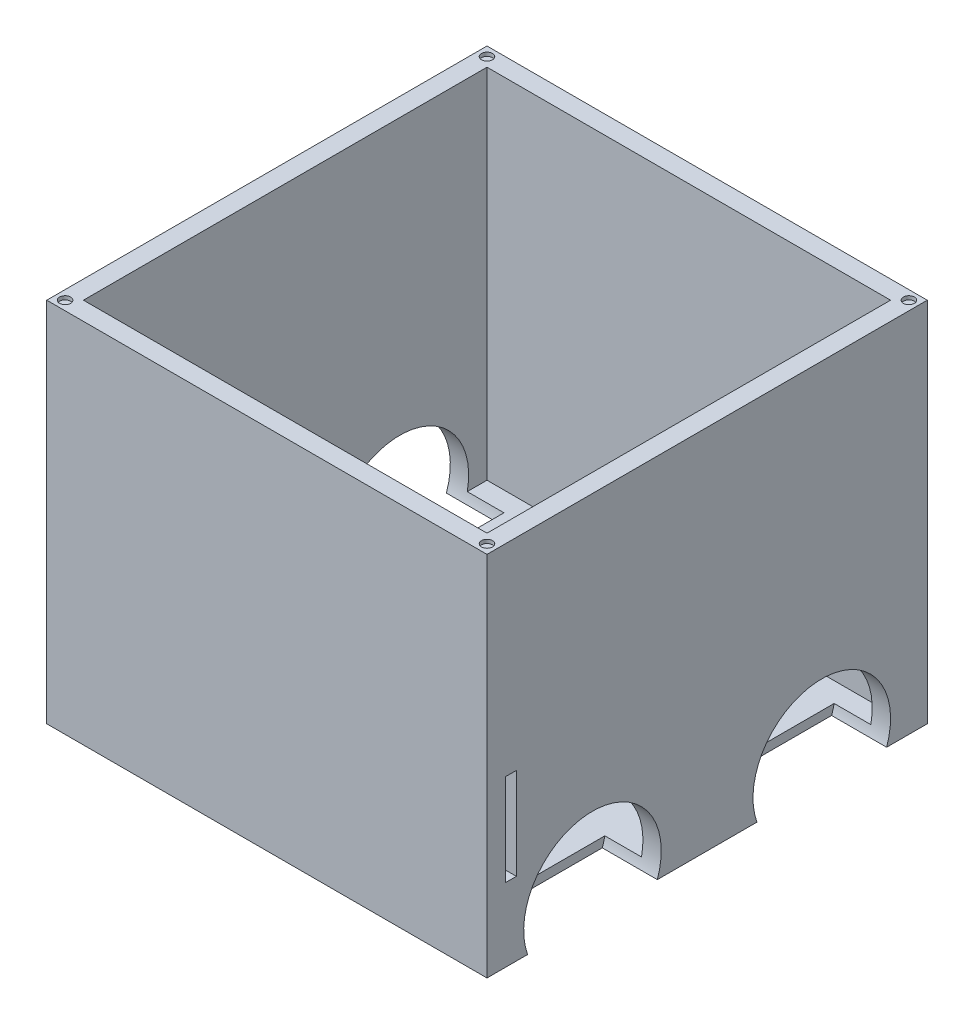
ISO-10303-21;
HEADER;
FILE_DESCRIPTION(('STEP AP214'),'2;1');
FILE_NAME('part.step','',(''),(''),'','','');
FILE_SCHEMA(('AUTOMOTIVE_DESIGN { 1 0 10303 214 1 1 1 1 }'));
ENDSEC;
DATA;
#1=APPLICATION_CONTEXT('core data for automotive mechanical design processes');
#2=APPLICATION_PROTOCOL_DEFINITION('international standard','automotive_design',2000,#1);
#3=PRODUCT_CONTEXT('',#1,'mechanical');
#4=PRODUCT('Part','Part','',(#3));
#5=PRODUCT_RELATED_PRODUCT_CATEGORY('part','',(#4));
#6=PRODUCT_DEFINITION_FORMATION('','',#4);
#7=PRODUCT_DEFINITION_CONTEXT('part definition',#1,'design');
#8=PRODUCT_DEFINITION('design','',#6,#7);
#9=PRODUCT_DEFINITION_SHAPE('','',#8);
#10=(LENGTH_UNIT() NAMED_UNIT(*) SI_UNIT(.MILLI.,.METRE.));
#11=(NAMED_UNIT(*) PLANE_ANGLE_UNIT() SI_UNIT($,.RADIAN.));
#12=(NAMED_UNIT(*) SI_UNIT($,.STERADIAN.) SOLID_ANGLE_UNIT());
#13=UNCERTAINTY_MEASURE_WITH_UNIT(LENGTH_MEASURE(1.E-05),#10,'distance_accuracy_value','');
#14=(GEOMETRIC_REPRESENTATION_CONTEXT(3) GLOBAL_UNCERTAINTY_ASSIGNED_CONTEXT((#13)) GLOBAL_UNIT_ASSIGNED_CONTEXT((#10,
#11,#12)) REPRESENTATION_CONTEXT('',''));
#15=CARTESIAN_POINT('',(0.,0.,0.));
#16=DIRECTION('',(0.,0.,1.));
#17=DIRECTION('',(1.,0.,0.));
#18=AXIS2_PLACEMENT_3D('',#15,#16,#17);
#19=CARTESIAN_POINT('',(120.,86.8979784031339,120.));
#20=DIRECTION('',(-1.,0.,0.));
#21=DIRECTION('',(0.,0.,1.));
#22=AXIS2_PLACEMENT_3D('',#19,#20,#21);
#23=PLANE('',#22);
#24=DIRECTION('',(0.,0.,-1.));
#25=VECTOR('',#24,1.);
#26=CARTESIAN_POINT('',(120.,-113.102021596866,120.));
#27=LINE('',#26,#25);
#28=CARTESIAN_POINT('',(120.,-113.102021596866,120.));
#29=VERTEX_POINT('',#28);
#30=CARTESIAN_POINT('',(120.,-113.102021596866,97.8553390593274));
#31=VERTEX_POINT('',#30);
#32=EDGE_CURVE('E432',#29,#31,#27,.T.);
#33=ORIENTED_EDGE('',*,*,#32,.T.);
#34=CARTESIAN_POINT('',(120.,-100.602021596866,62.5));
#35=DIRECTION('',(1.,0.,0.));
#36=DIRECTION('',(0.,0.,-1.));
#37=AXIS2_PLACEMENT_3D('',#34,#35,#36);
#38=CIRCLE('',#37,37.5);
#39=CARTESIAN_POINT('',(120.,-113.102021596866,27.1446609406726));
#40=VERTEX_POINT('',#39);
#41=EDGE_CURVE('E355',#40,#31,#38,.T.);
#42=ORIENTED_EDGE('',*,*,#41,.F.);
#43=CARTESIAN_POINT('',(120.,-113.102021596866,-27.1446609406726));
#44=VERTEX_POINT('',#43);
#45=EDGE_CURVE('E436',#40,#44,#27,.T.);
#46=ORIENTED_EDGE('',*,*,#45,.T.);
#47=CARTESIAN_POINT('',(120.,-100.602021596866,-62.5));
#48=DIRECTION('',(1.,0.,0.));
#49=DIRECTION('',(0.,0.,-1.));
#50=AXIS2_PLACEMENT_3D('',#47,#48,#49);
#51=CIRCLE('',#50,37.5);
#52=CARTESIAN_POINT('',(120.,-113.102021596866,-97.8553390593274));
#53=VERTEX_POINT('',#52);
#54=EDGE_CURVE('E357',#53,#44,#51,.T.);
#55=ORIENTED_EDGE('',*,*,#54,.F.);
#56=CARTESIAN_POINT('',(120.,-113.102021596866,-120.));
#57=VERTEX_POINT('',#56);
#58=EDGE_CURVE('E411',#53,#57,#27,.T.);
#59=ORIENTED_EDGE('',*,*,#58,.T.);
#60=DIRECTION('',(0.,-1.,0.));
#61=VECTOR('',#60,1.);
#62=CARTESIAN_POINT('',(120.,86.8979784031339,-120.));
#63=LINE('',#62,#61);
#64=CARTESIAN_POINT('',(120.,86.8979784031339,-120.));
#65=VERTEX_POINT('',#64);
#66=EDGE_CURVE('E452',#65,#57,#63,.T.);
#67=ORIENTED_EDGE('',*,*,#66,.F.);
#68=DIRECTION('',(0.,0.,-1.));
#69=VECTOR('',#68,1.);
#70=CARTESIAN_POINT('',(120.,86.8979784031339,120.));
#71=LINE('',#70,#69);
#72=CARTESIAN_POINT('',(120.,86.8979784031339,120.));
#73=VERTEX_POINT('',#72);
#74=EDGE_CURVE('E421',#73,#65,#71,.T.);
#75=ORIENTED_EDGE('',*,*,#74,.F.);
#76=DIRECTION('',(0.,-1.,0.));
#77=VECTOR('',#76,1.);
#78=CARTESIAN_POINT('',(120.,86.8979784031339,120.));
#79=LINE('',#78,#77);
#80=EDGE_CURVE('E431',#73,#29,#79,.T.);
#81=ORIENTED_EDGE('',*,*,#80,.T.);
#82=EDGE_LOOP('',(#33,#42,#46,#55,#59,#67,#75,#81));
#83=FACE_BOUND('',#82,.T.);
#84=DIRECTION('',(0.,0.,1.));
#85=VECTOR('',#84,1.);
#86=CARTESIAN_POINT('',(120.,-23.1020215968661,104.));
#87=LINE('',#86,#85);
#88=CARTESIAN_POINT('',(120.,-23.1020215968661,104.));
#89=VERTEX_POINT('',#88);
#90=CARTESIAN_POINT('',(120.,-23.1020215968661,110.));
#91=VERTEX_POINT('',#90);
#92=EDGE_CURVE('E246',#89,#91,#87,.T.);
#93=ORIENTED_EDGE('',*,*,#92,.F.);
#94=DIRECTION('',(0.,1.,0.));
#95=VECTOR('',#94,1.);
#96=CARTESIAN_POINT('',(120.,-73.1020215968661,104.));
#97=LINE('',#96,#95);
#98=CARTESIAN_POINT('',(120.,-73.1020215968661,104.));
#99=VERTEX_POINT('',#98);
#100=EDGE_CURVE('E271',#99,#89,#97,.T.);
#101=ORIENTED_EDGE('',*,*,#100,.F.);
#102=DIRECTION('',(0.,0.,-1.));
#103=VECTOR('',#102,1.);
#104=CARTESIAN_POINT('',(120.,-73.1020215968661,110.));
#105=LINE('',#104,#103);
#106=CARTESIAN_POINT('',(120.,-73.1020215968661,110.));
#107=VERTEX_POINT('',#106);
#108=EDGE_CURVE('E269',#107,#99,#105,.T.);
#109=ORIENTED_EDGE('',*,*,#108,.F.);
#110=DIRECTION('',(0.,-1.,0.));
#111=VECTOR('',#110,1.);
#112=CARTESIAN_POINT('',(120.,-23.1020215968661,110.));
#113=LINE('',#112,#111);
#114=EDGE_CURVE('E256',#91,#107,#113,.T.);
#115=ORIENTED_EDGE('',*,*,#114,.F.);
#116=EDGE_LOOP('',(#93,#101,#109,#115));
#117=FACE_BOUND('',#116,.T.);
#118=ADVANCED_FACE('F39',(#83,#117),#23,.F.);
#119=CARTESIAN_POINT('',(-120.,86.8979784031339,120.));
#120=DIRECTION('',(1.,0.,0.));
#121=DIRECTION('',(0.,0.,-1.));
#122=AXIS2_PLACEMENT_3D('',#119,#120,#121);
#123=PLANE('',#122);
#124=DIRECTION('',(0.,0.,1.));
#125=VECTOR('',#124,1.);
#126=CARTESIAN_POINT('',(-120.,-113.102021596866,120.));
#127=LINE('',#126,#125);
#128=CARTESIAN_POINT('',(-120.,-113.102021596866,-27.1446609406726));
#129=VERTEX_POINT('',#128);
#130=CARTESIAN_POINT('',(-120.,-113.102021596866,27.1446609406726));
#131=VERTEX_POINT('',#130);
#132=EDGE_CURVE('E442',#129,#131,#127,.T.);
#133=ORIENTED_EDGE('',*,*,#132,.T.);
#134=CARTESIAN_POINT('',(-120.,-100.602021596866,62.5));
#135=DIRECTION('',(-1.,0.,0.));
#136=DIRECTION('',(0.,0.,1.));
#137=AXIS2_PLACEMENT_3D('',#134,#135,#136);
#138=CIRCLE('',#137,37.5);
#139=CARTESIAN_POINT('',(-120.,-113.102021596866,97.8553390593274));
#140=VERTEX_POINT('',#139);
#141=EDGE_CURVE('E323',#140,#131,#138,.T.);
#142=ORIENTED_EDGE('',*,*,#141,.F.);
#143=CARTESIAN_POINT('',(-120.,-113.102021596866,120.));
#144=VERTEX_POINT('',#143);
#145=EDGE_CURVE('E438',#140,#144,#127,.T.);
#146=ORIENTED_EDGE('',*,*,#145,.T.);
#147=DIRECTION('',(0.,-1.,0.));
#148=VECTOR('',#147,1.);
#149=CARTESIAN_POINT('',(-120.,86.8979784031339,120.));
#150=LINE('',#149,#148);
#151=CARTESIAN_POINT('',(-120.,86.8979784031339,120.));
#152=VERTEX_POINT('',#151);
#153=EDGE_CURVE('E446',#152,#144,#150,.T.);
#154=ORIENTED_EDGE('',*,*,#153,.F.);
#155=DIRECTION('',(0.,0.,1.));
#156=VECTOR('',#155,1.);
#157=CARTESIAN_POINT('',(-120.,86.8979784031339,120.));
#158=LINE('',#157,#156);
#159=CARTESIAN_POINT('',(-120.,86.8979784031339,-120.));
#160=VERTEX_POINT('',#159);
#161=EDGE_CURVE('E427',#160,#152,#158,.T.);
#162=ORIENTED_EDGE('',*,*,#161,.F.);
#163=DIRECTION('',(0.,-1.,0.));
#164=VECTOR('',#163,1.);
#165=CARTESIAN_POINT('',(-120.,86.8979784031339,-120.));
#166=LINE('',#165,#164);
#167=CARTESIAN_POINT('',(-120.,-113.102021596866,-120.));
#168=VERTEX_POINT('',#167);
#169=EDGE_CURVE('E449',#160,#168,#166,.T.);
#170=ORIENTED_EDGE('',*,*,#169,.T.);
#171=CARTESIAN_POINT('',(-120.,-113.102021596866,-97.8553390593274));
#172=VERTEX_POINT('',#171);
#173=EDGE_CURVE('E439',#168,#172,#127,.T.);
#174=ORIENTED_EDGE('',*,*,#173,.T.);
#175=CARTESIAN_POINT('',(-120.,-100.602021596866,-62.5));
#176=DIRECTION('',(-1.,0.,0.));
#177=DIRECTION('',(0.,0.,1.));
#178=AXIS2_PLACEMENT_3D('',#175,#176,#177);
#179=CIRCLE('',#178,37.5);
#180=EDGE_CURVE('E325',#129,#172,#179,.T.);
#181=ORIENTED_EDGE('',*,*,#180,.F.);
#182=EDGE_LOOP('',(#133,#142,#146,#154,#162,#170,#174,#181));
#183=FACE_BOUND('',#182,.T.);
#184=DIRECTION('',(0.,0.,-1.));
#185=VECTOR('',#184,1.);
#186=CARTESIAN_POINT('',(-120.,-23.1020215968661,120.));
#187=LINE('',#186,#185);
#188=CARTESIAN_POINT('',(-120.,-23.1020215968661,110.));
#189=VERTEX_POINT('',#188);
#190=CARTESIAN_POINT('',(-120.,-23.1020215968661,104.));
#191=VERTEX_POINT('',#190);
#192=EDGE_CURVE('E292',#189,#191,#187,.T.);
#193=ORIENTED_EDGE('',*,*,#192,.F.);
#194=DIRECTION('',(0.,1.,0.));
#195=VECTOR('',#194,1.);
#196=CARTESIAN_POINT('',(-120.,86.8979784031339,110.));
#197=LINE('',#196,#195);
#198=CARTESIAN_POINT('',(-120.,-73.1020215968661,110.));
#199=VERTEX_POINT('',#198);
#200=EDGE_CURVE('E288',#199,#189,#197,.T.);
#201=ORIENTED_EDGE('',*,*,#200,.F.);
#202=DIRECTION('',(0.,0.,1.));
#203=VECTOR('',#202,1.);
#204=CARTESIAN_POINT('',(-120.,-73.1020215968661,120.));
#205=LINE('',#204,#203);
#206=CARTESIAN_POINT('',(-120.,-73.1020215968661,104.));
#207=VERTEX_POINT('',#206);
#208=EDGE_CURVE('E286',#207,#199,#205,.T.);
#209=ORIENTED_EDGE('',*,*,#208,.F.);
#210=DIRECTION('',(0.,-1.,0.));
#211=VECTOR('',#210,1.);
#212=CARTESIAN_POINT('',(-120.,86.8979784031339,104.));
#213=LINE('',#212,#211);
#214=EDGE_CURVE('E282',#191,#207,#213,.T.);
#215=ORIENTED_EDGE('',*,*,#214,.F.);
#216=EDGE_LOOP('',(#193,#201,#209,#215));
#217=FACE_BOUND('',#216,.T.);
#218=ADVANCED_FACE('F510',(#183,#217),#123,.F.);
#219=CARTESIAN_POINT('',(110.,-108.102021596866,-110.));
#220=DIRECTION('',(1.,0.,0.));
#221=DIRECTION('',(0.,0.,-1.));
#222=AXIS2_PLACEMENT_3D('',#219,#220,#221);
#223=PLANE('',#222);
#224=DIRECTION('',(0.,0.,-1.));
#225=VECTOR('',#224,1.);
#226=CARTESIAN_POINT('',(110.,-23.1020215968661,-110.));
#227=LINE('',#226,#225);
#228=CARTESIAN_POINT('',(110.,-23.1020215968661,110.));
#229=VERTEX_POINT('',#228);
#230=CARTESIAN_POINT('',(110.,-23.1020215968661,104.));
#231=VERTEX_POINT('',#230);
#232=EDGE_CURVE('E290',#229,#231,#227,.T.);
#233=ORIENTED_EDGE('',*,*,#232,.F.);
#234=DIRECTION('',(0.,1.,0.));
#235=VECTOR('',#234,1.);
#236=CARTESIAN_POINT('',(110.,-108.102021596866,110.));
#237=LINE('',#236,#235);
#238=CARTESIAN_POINT('',(110.,86.8979784031339,110.));
#239=VERTEX_POINT('',#238);
#240=EDGE_CURVE('E264',#229,#239,#237,.T.);
#241=ORIENTED_EDGE('',*,*,#240,.T.);
#242=DIRECTION('',(0.,0.,-1.));
#243=VECTOR('',#242,1.);
#244=CARTESIAN_POINT('',(110.,86.8979784031339,-110.));
#245=LINE('',#244,#243);
#246=CARTESIAN_POINT('',(110.,86.8979784031339,-110.));
#247=VERTEX_POINT('',#246);
#248=EDGE_CURVE('E387',#239,#247,#245,.T.);
#249=ORIENTED_EDGE('',*,*,#248,.T.);
#250=DIRECTION('',(0.,1.,0.));
#251=VECTOR('',#250,1.);
#252=CARTESIAN_POINT('',(110.,-108.102021596866,-110.));
#253=LINE('',#252,#251);
#254=CARTESIAN_POINT('',(110.,-108.102021596866,-110.));
#255=VERTEX_POINT('',#254);
#256=EDGE_CURVE('E409',#255,#247,#253,.T.);
#257=ORIENTED_EDGE('',*,*,#256,.F.);
#258=DIRECTION('',(0.,0.,-1.));
#259=VECTOR('',#258,1.);
#260=CARTESIAN_POINT('',(110.,-108.102021596866,-110.));
#261=LINE('',#260,#259);
#262=CARTESIAN_POINT('',(110.,-108.102021596866,-99.2423461417477));
#263=VERTEX_POINT('',#262);
#264=EDGE_CURVE('E395',#263,#255,#261,.T.);
#265=ORIENTED_EDGE('',*,*,#264,.F.);
#266=CARTESIAN_POINT('',(110.,-100.602021596866,-62.5));
#267=DIRECTION('',(1.,0.,0.));
#268=DIRECTION('',(0.,0.,-1.));
#269=AXIS2_PLACEMENT_3D('',#266,#267,#268);
#270=CIRCLE('',#269,37.5);
#271=CARTESIAN_POINT('',(110.,-108.102021596866,-25.7576538582523));
#272=VERTEX_POINT('',#271);
#273=EDGE_CURVE('E363',#263,#272,#270,.T.);
#274=ORIENTED_EDGE('',*,*,#273,.T.);
#275=CARTESIAN_POINT('',(110.,-108.102021596866,25.7576538582523));
#276=VERTEX_POINT('',#275);
#277=EDGE_CURVE('E400',#276,#272,#261,.T.);
#278=ORIENTED_EDGE('',*,*,#277,.F.);
#279=CARTESIAN_POINT('',(110.,-100.602021596866,62.5));
#280=DIRECTION('',(1.,0.,0.));
#281=DIRECTION('',(0.,0.,-1.));
#282=AXIS2_PLACEMENT_3D('',#279,#280,#281);
#283=CIRCLE('',#282,37.5);
#284=CARTESIAN_POINT('',(110.,-108.102021596866,99.2423461417477));
#285=VERTEX_POINT('',#284);
#286=EDGE_CURVE('E374',#276,#285,#283,.T.);
#287=ORIENTED_EDGE('',*,*,#286,.T.);
#288=CARTESIAN_POINT('',(110.,-108.102021596866,110.));
#289=VERTEX_POINT('',#288);
#290=EDGE_CURVE('E396',#289,#285,#261,.T.);
#291=ORIENTED_EDGE('',*,*,#290,.F.);
#292=CARTESIAN_POINT('',(110.,-73.1020215968661,110.));
#293=VERTEX_POINT('',#292);
#294=EDGE_CURVE('E412',#289,#293,#237,.T.);
#295=ORIENTED_EDGE('',*,*,#294,.T.);
#296=DIRECTION('',(0.,0.,1.));
#297=VECTOR('',#296,1.);
#298=CARTESIAN_POINT('',(110.,-73.1020215968661,-110.));
#299=LINE('',#298,#297);
#300=CARTESIAN_POINT('',(110.,-73.1020215968661,104.));
#301=VERTEX_POINT('',#300);
#302=EDGE_CURVE('E284',#301,#293,#299,.T.);
#303=ORIENTED_EDGE('',*,*,#302,.F.);
#304=DIRECTION('',(0.,-1.,0.));
#305=VECTOR('',#304,1.);
#306=CARTESIAN_POINT('',(110.,-108.102021596866,104.));
#307=LINE('',#306,#305);
#308=EDGE_CURVE('E265',#231,#301,#307,.T.);
#309=ORIENTED_EDGE('',*,*,#308,.F.);
#310=EDGE_LOOP('',(#233,#241,#249,#257,#265,#274,#278,#287,#291,#295,#303,#309));
#311=FACE_BOUND('',#310,.T.);
#312=ADVANCED_FACE('F535',(#311),#223,.F.);
#313=CARTESIAN_POINT('',(-110.,-108.102021596866,110.));
#314=DIRECTION('',(-1.,0.,0.));
#315=DIRECTION('',(0.,0.,1.));
#316=AXIS2_PLACEMENT_3D('',#313,#314,#315);
#317=PLANE('',#316);
#318=DIRECTION('',(0.,0.,1.));
#319=VECTOR('',#318,1.);
#320=CARTESIAN_POINT('',(-110.,-23.1020215968661,110.));
#321=LINE('',#320,#319);
#322=CARTESIAN_POINT('',(-110.,-23.1020215968661,104.));
#323=VERTEX_POINT('',#322);
#324=CARTESIAN_POINT('',(-110.,-23.1020215968661,110.));
#325=VERTEX_POINT('',#324);
#326=EDGE_CURVE('E11',#323,#325,#321,.T.);
#327=ORIENTED_EDGE('',*,*,#326,.F.);
#328=DIRECTION('',(0.,1.,0.));
#329=VECTOR('',#328,1.);
#330=CARTESIAN_POINT('',(-110.,-108.102021596866,104.));
#331=LINE('',#330,#329);
#332=CARTESIAN_POINT('',(-110.,-73.1020215968661,104.));
#333=VERTEX_POINT('',#332);
#334=EDGE_CURVE('E487',#333,#323,#331,.T.);
#335=ORIENTED_EDGE('',*,*,#334,.F.);
#336=DIRECTION('',(0.,0.,-1.));
#337=VECTOR('',#336,1.);
#338=CARTESIAN_POINT('',(-110.,-73.1020215968661,110.));
#339=LINE('',#338,#337);
#340=CARTESIAN_POINT('',(-110.,-73.1020215968661,110.));
#341=VERTEX_POINT('',#340);
#342=EDGE_CURVE('E46',#341,#333,#339,.T.);
#343=ORIENTED_EDGE('',*,*,#342,.F.);
#344=DIRECTION('',(0.,1.,0.));
#345=VECTOR('',#344,1.);
#346=CARTESIAN_POINT('',(-110.,-108.102021596866,110.));
#347=LINE('',#346,#345);
#348=CARTESIAN_POINT('',(-110.,-108.102021596866,110.));
#349=VERTEX_POINT('',#348);
#350=EDGE_CURVE('E415',#349,#341,#347,.T.);
#351=ORIENTED_EDGE('',*,*,#350,.F.);
#352=DIRECTION('',(0.,0.,1.));
#353=VECTOR('',#352,1.);
#354=CARTESIAN_POINT('',(-110.,-108.102021596866,110.));
#355=LINE('',#354,#353);
#356=CARTESIAN_POINT('',(-110.,-108.102021596866,99.2423461417477));
#357=VERTEX_POINT('',#356);
#358=EDGE_CURVE('E386',#357,#349,#355,.T.);
#359=ORIENTED_EDGE('',*,*,#358,.F.);
#360=CARTESIAN_POINT('',(-110.,-100.602021596866,62.5));
#361=DIRECTION('',(-1.,0.,0.));
#362=DIRECTION('',(0.,0.,1.));
#363=AXIS2_PLACEMENT_3D('',#360,#361,#362);
#364=CIRCLE('',#363,37.5);
#365=CARTESIAN_POINT('',(-110.,-108.102021596866,25.7576538582523));
#366=VERTEX_POINT('',#365);
#367=EDGE_CURVE('E342',#357,#366,#364,.T.);
#368=ORIENTED_EDGE('',*,*,#367,.T.);
#369=CARTESIAN_POINT('',(-110.,-108.102021596866,-25.7576538582523));
#370=VERTEX_POINT('',#369);
#371=EDGE_CURVE('E392',#370,#366,#355,.T.);
#372=ORIENTED_EDGE('',*,*,#371,.F.);
#373=CARTESIAN_POINT('',(-110.,-100.602021596866,-62.5));
#374=DIRECTION('',(-1.,0.,0.));
#375=DIRECTION('',(0.,0.,1.));
#376=AXIS2_PLACEMENT_3D('',#373,#374,#375);
#377=CIRCLE('',#376,37.5);
#378=CARTESIAN_POINT('',(-110.,-108.102021596866,-99.2423461417477));
#379=VERTEX_POINT('',#378);
#380=EDGE_CURVE('E331',#370,#379,#377,.T.);
#381=ORIENTED_EDGE('',*,*,#380,.T.);
#382=CARTESIAN_POINT('',(-110.,-108.102021596866,-110.));
#383=VERTEX_POINT('',#382);
#384=EDGE_CURVE('E388',#383,#379,#355,.T.);
#385=ORIENTED_EDGE('',*,*,#384,.F.);
#386=DIRECTION('',(0.,1.,0.));
#387=VECTOR('',#386,1.);
#388=CARTESIAN_POINT('',(-110.,-108.102021596866,-110.));
#389=LINE('',#388,#387);
#390=CARTESIAN_POINT('',(-110.,86.8979784031339,-110.));
#391=VERTEX_POINT('',#390);
#392=EDGE_CURVE('E399',#383,#391,#389,.T.);
#393=ORIENTED_EDGE('',*,*,#392,.T.);
#394=DIRECTION('',(0.,0.,1.));
#395=VECTOR('',#394,1.);
#396=CARTESIAN_POINT('',(-110.,86.8979784031339,110.));
#397=LINE('',#396,#395);
#398=CARTESIAN_POINT('',(-110.,86.8979784031339,110.));
#399=VERTEX_POINT('',#398);
#400=EDGE_CURVE('E402',#391,#399,#397,.T.);
#401=ORIENTED_EDGE('',*,*,#400,.T.);
#402=EDGE_CURVE('E418',#325,#399,#347,.T.);
#403=ORIENTED_EDGE('',*,*,#402,.F.);
#404=EDGE_LOOP('',(#327,#335,#343,#351,#359,#368,#372,#381,#385,#393,#401,#403));
#405=FACE_BOUND('',#404,.T.);
#406=ADVANCED_FACE('F499',(#405),#317,.F.);
#407=CARTESIAN_POINT('',(-120.,86.8979784031339,-120.));
#408=DIRECTION('',(0.,0.,1.));
#409=DIRECTION('',(1.,0.,0.));
#410=AXIS2_PLACEMENT_3D('',#407,#408,#409);
#411=PLANE('',#410);
#412=DIRECTION('',(-1.,0.,0.));
#413=VECTOR('',#412,1.);
#414=CARTESIAN_POINT('',(-120.,-113.102021596866,-120.));
#415=LINE('',#414,#413);
#416=EDGE_CURVE('E435',#57,#168,#415,.T.);
#417=ORIENTED_EDGE('',*,*,#416,.T.);
#418=ORIENTED_EDGE('',*,*,#169,.F.);
#419=DIRECTION('',(-1.,0.,0.));
#420=VECTOR('',#419,1.);
#421=CARTESIAN_POINT('',(-120.,86.8979784031339,-120.));
#422=LINE('',#421,#420);
#423=EDGE_CURVE('E424',#65,#160,#422,.T.);
#424=ORIENTED_EDGE('',*,*,#423,.F.);
#425=ORIENTED_EDGE('',*,*,#66,.T.);
#426=EDGE_LOOP('',(#417,#418,#424,#425));
#427=FACE_BOUND('',#426,.T.);
#428=ADVANCED_FACE('F579',(#427),#411,.F.);
#429=CARTESIAN_POINT('',(-120.,86.8979784031339,120.));
#430=DIRECTION('',(0.,0.,-1.));
#431=DIRECTION('',(-1.,0.,0.));
#432=AXIS2_PLACEMENT_3D('',#429,#430,#431);
#433=PLANE('',#432);
#434=DIRECTION('',(1.,0.,0.));
#435=VECTOR('',#434,1.);
#436=CARTESIAN_POINT('',(-120.,-113.102021596866,120.));
#437=LINE('',#436,#435);
#438=EDGE_CURVE('E425',#144,#29,#437,.T.);
#439=ORIENTED_EDGE('',*,*,#438,.T.);
#440=ORIENTED_EDGE('',*,*,#80,.F.);
#441=DIRECTION('',(1.,0.,0.));
#442=VECTOR('',#441,1.);
#443=CARTESIAN_POINT('',(-120.,86.8979784031339,120.));
#444=LINE('',#443,#442);
#445=EDGE_CURVE('E429',#152,#73,#444,.T.);
#446=ORIENTED_EDGE('',*,*,#445,.F.);
#447=ORIENTED_EDGE('',*,*,#153,.T.);
#448=EDGE_LOOP('',(#439,#440,#446,#447));
#449=FACE_BOUND('',#448,.T.);
#450=ADVANCED_FACE('F587',(#449),#433,.F.);
#451=CARTESIAN_POINT('',(0.,86.8979784031339,0.));
#452=DIRECTION('',(0.,-1.,0.));
#453=DIRECTION('',(0.,0.,-1.));
#454=AXIS2_PLACEMENT_3D('',#451,#452,#453);
#455=PLANE('',#454);
#456=CARTESIAN_POINT('',(115.,86.8979784031339,-115.));
#457=DIRECTION('',(0.,1.,0.));
#458=DIRECTION('',(0.,0.,-1.));
#459=AXIS2_PLACEMENT_3D('',#456,#457,#458);
#460=CIRCLE('',#459,3.00000000000001);
#461=CARTESIAN_POINT('',(115.,86.8979784031339,-118.));
#462=VERTEX_POINT('',#461);
#463=EDGE_CURVE('E308',#462,#462,#460,.T.);
#464=ORIENTED_EDGE('',*,*,#463,.F.);
#465=EDGE_LOOP('',(#464));
#466=FACE_BOUND('',#465,.T.);
#467=CARTESIAN_POINT('',(115.,86.8979784031339,115.));
#468=DIRECTION('',(0.,1.,0.));
#469=DIRECTION('',(0.,0.,1.));
#470=AXIS2_PLACEMENT_3D('',#467,#468,#469);
#471=CIRCLE('',#470,3.00000000000001);
#472=CARTESIAN_POINT('',(115.,86.8979784031339,118.));
#473=VERTEX_POINT('',#472);
#474=EDGE_CURVE('E302',#473,#473,#471,.T.);
#475=ORIENTED_EDGE('',*,*,#474,.F.);
#476=EDGE_LOOP('',(#475));
#477=FACE_BOUND('',#476,.T.);
#478=CARTESIAN_POINT('',(-115.,86.8979784031339,115.));
#479=DIRECTION('',(0.,1.,0.));
#480=DIRECTION('',(0.,0.,-1.));
#481=AXIS2_PLACEMENT_3D('',#478,#479,#480);
#482=CIRCLE('',#481,3.00000000000001);
#483=CARTESIAN_POINT('',(-115.,86.8979784031339,112.));
#484=VERTEX_POINT('',#483);
#485=EDGE_CURVE('E295',#484,#484,#482,.T.);
#486=ORIENTED_EDGE('',*,*,#485,.F.);
#487=EDGE_LOOP('',(#486));
#488=FACE_BOUND('',#487,.T.);
#489=CARTESIAN_POINT('',(-115.,86.8979784031339,-115.));
#490=DIRECTION('',(0.,1.,0.));
#491=DIRECTION('',(0.,0.,1.));
#492=AXIS2_PLACEMENT_3D('',#489,#490,#491);
#493=CIRCLE('',#492,3.00000000000001);
#494=CARTESIAN_POINT('',(-115.,86.8979784031339,-112.));
#495=VERTEX_POINT('',#494);
#496=EDGE_CURVE('E298',#495,#495,#493,.T.);
#497=ORIENTED_EDGE('',*,*,#496,.F.);
#498=EDGE_LOOP('',(#497));
#499=FACE_BOUND('',#498,.T.);
#500=ORIENTED_EDGE('',*,*,#400,.F.);
#501=DIRECTION('',(-1.,0.,0.));
#502=VECTOR('',#501,1.);
#503=CARTESIAN_POINT('',(-110.,86.8979784031339,-110.));
#504=LINE('',#503,#502);
#505=EDGE_CURVE('E382',#247,#391,#504,.T.);
#506=ORIENTED_EDGE('',*,*,#505,.F.);
#507=ORIENTED_EDGE('',*,*,#248,.F.);
#508=DIRECTION('',(1.,0.,0.));
#509=VECTOR('',#508,1.);
#510=CARTESIAN_POINT('',(110.,86.8979784031339,110.));
#511=LINE('',#510,#509);
#512=EDGE_CURVE('E405',#399,#239,#511,.T.);
#513=ORIENTED_EDGE('',*,*,#512,.F.);
#514=EDGE_LOOP('',(#500,#506,#507,#513));
#515=FACE_BOUND('',#514,.T.);
#516=ORIENTED_EDGE('',*,*,#74,.T.);
#517=ORIENTED_EDGE('',*,*,#423,.T.);
#518=ORIENTED_EDGE('',*,*,#161,.T.);
#519=ORIENTED_EDGE('',*,*,#445,.T.);
#520=EDGE_LOOP('',(#516,#517,#518,#519));
#521=FACE_BOUND('',#520,.T.);
#522=ADVANCED_FACE('F531',(#466,#477,#488,#499,#515,#521),#455,.F.);
#523=CARTESIAN_POINT('',(0.,-113.102021596866,0.));
#524=DIRECTION('',(0.,-1.,0.));
#525=DIRECTION('',(0.,0.,-1.));
#526=AXIS2_PLACEMENT_3D('',#523,#524,#525);
#527=PLANE('',#526);
#528=DIRECTION('',(-1.,0.,0.));
#529=VECTOR('',#528,1.);
#530=CARTESIAN_POINT('',(-90.,-113.102021596866,97.8553390593274));
#531=LINE('',#530,#529);
#532=CARTESIAN_POINT('',(-90.,-113.102021596866,97.8553390593274));
#533=VERTEX_POINT('',#532);
#534=EDGE_CURVE('E348',#533,#140,#531,.T.);
#535=ORIENTED_EDGE('',*,*,#534,.F.);
#536=DIRECTION('',(0.,0.,-1.));
#537=VECTOR('',#536,1.);
#538=CARTESIAN_POINT('',(-90.,-113.102021596866,0.));
#539=LINE('',#538,#537);
#540=CARTESIAN_POINT('',(-90.,-113.102021596866,27.1446609406726));
#541=VERTEX_POINT('',#540);
#542=EDGE_CURVE('E339',#533,#541,#539,.T.);
#543=ORIENTED_EDGE('',*,*,#542,.T.);
#544=DIRECTION('',(-1.,0.,0.));
#545=VECTOR('',#544,1.);
#546=CARTESIAN_POINT('',(-90.,-113.102021596866,27.1446609406726));
#547=LINE('',#546,#545);
#548=EDGE_CURVE('E345',#131,#541,#547,.F.);
#549=ORIENTED_EDGE('',*,*,#548,.F.);
#550=ORIENTED_EDGE('',*,*,#132,.F.);
#551=DIRECTION('',(-1.,0.,0.));
#552=VECTOR('',#551,1.);
#553=CARTESIAN_POINT('',(-90.,-113.102021596866,-27.1446609406726));
#554=LINE('',#553,#552);
#555=CARTESIAN_POINT('',(-90.,-113.102021596866,-27.1446609406726));
#556=VERTEX_POINT('',#555);
#557=EDGE_CURVE('E337',#556,#129,#554,.T.);
#558=ORIENTED_EDGE('',*,*,#557,.F.);
#559=DIRECTION('',(0.,0.,-1.));
#560=VECTOR('',#559,1.);
#561=CARTESIAN_POINT('',(-90.,-113.102021596866,0.));
#562=LINE('',#561,#560);
#563=CARTESIAN_POINT('',(-90.,-113.102021596866,-97.8553390593274));
#564=VERTEX_POINT('',#563);
#565=EDGE_CURVE('E321',#556,#564,#562,.T.);
#566=ORIENTED_EDGE('',*,*,#565,.T.);
#567=DIRECTION('',(-1.,0.,0.));
#568=VECTOR('',#567,1.);
#569=CARTESIAN_POINT('',(-90.,-113.102021596866,-97.8553390593274));
#570=LINE('',#569,#568);
#571=EDGE_CURVE('E334',#172,#564,#570,.F.);
#572=ORIENTED_EDGE('',*,*,#571,.F.);
#573=ORIENTED_EDGE('',*,*,#173,.F.);
#574=ORIENTED_EDGE('',*,*,#416,.F.);
#575=ORIENTED_EDGE('',*,*,#58,.F.);
#576=DIRECTION('',(1.,0.,0.));
#577=VECTOR('',#576,1.);
#578=CARTESIAN_POINT('',(90.,-113.102021596866,-97.8553390593274));
#579=LINE('',#578,#577);
#580=CARTESIAN_POINT('',(90.,-113.102021596866,-97.8553390593274));
#581=VERTEX_POINT('',#580);
#582=EDGE_CURVE('E369',#581,#53,#579,.T.);
#583=ORIENTED_EDGE('',*,*,#582,.F.);
#584=DIRECTION('',(0.,0.,1.));
#585=VECTOR('',#584,1.);
#586=CARTESIAN_POINT('',(90.,-113.102021596866,0.));
#587=LINE('',#586,#585);
#588=CARTESIAN_POINT('',(90.,-113.102021596866,-27.1446609406726));
#589=VERTEX_POINT('',#588);
#590=EDGE_CURVE('E353',#581,#589,#587,.T.);
#591=ORIENTED_EDGE('',*,*,#590,.T.);
#592=DIRECTION('',(1.,0.,0.));
#593=VECTOR('',#592,1.);
#594=CARTESIAN_POINT('',(90.,-113.102021596866,-27.1446609406726));
#595=LINE('',#594,#593);
#596=EDGE_CURVE('E366',#44,#589,#595,.F.);
#597=ORIENTED_EDGE('',*,*,#596,.F.);
#598=ORIENTED_EDGE('',*,*,#45,.F.);
#599=DIRECTION('',(1.,0.,0.));
#600=VECTOR('',#599,1.);
#601=CARTESIAN_POINT('',(90.,-113.102021596866,27.1446609406726));
#602=LINE('',#601,#600);
#603=CARTESIAN_POINT('',(90.,-113.102021596866,27.1446609406726));
#604=VERTEX_POINT('',#603);
#605=EDGE_CURVE('E380',#604,#40,#602,.T.);
#606=ORIENTED_EDGE('',*,*,#605,.F.);
#607=DIRECTION('',(0.,0.,1.));
#608=VECTOR('',#607,1.);
#609=CARTESIAN_POINT('',(90.,-113.102021596866,0.));
#610=LINE('',#609,#608);
#611=CARTESIAN_POINT('',(90.,-113.102021596866,97.8553390593274));
#612=VERTEX_POINT('',#611);
#613=EDGE_CURVE('E371',#604,#612,#610,.T.);
#614=ORIENTED_EDGE('',*,*,#613,.T.);
#615=DIRECTION('',(1.,0.,0.));
#616=VECTOR('',#615,1.);
#617=CARTESIAN_POINT('',(90.,-113.102021596866,97.8553390593274));
#618=LINE('',#617,#616);
#619=EDGE_CURVE('E377',#31,#612,#618,.F.);
#620=ORIENTED_EDGE('',*,*,#619,.F.);
#621=ORIENTED_EDGE('',*,*,#32,.F.);
#622=ORIENTED_EDGE('',*,*,#438,.F.);
#623=ORIENTED_EDGE('',*,*,#145,.F.);
#624=EDGE_LOOP('',(#535,#543,#549,#550,#558,#566,#572,#573,#574,#575,#583,#591,#597,#598,#606,
#614,#620,#621,#622,#623));
#625=FACE_BOUND('',#624,.T.);
#626=ADVANCED_FACE('F569',(#625),#527,.T.);
#627=CARTESIAN_POINT('',(-110.,-108.102021596866,-110.));
#628=DIRECTION('',(0.,0.,-1.));
#629=DIRECTION('',(-1.,0.,0.));
#630=AXIS2_PLACEMENT_3D('',#627,#628,#629);
#631=PLANE('',#630);
#632=ORIENTED_EDGE('',*,*,#505,.T.);
#633=ORIENTED_EDGE('',*,*,#392,.F.);
#634=DIRECTION('',(-1.,0.,0.));
#635=VECTOR('',#634,1.);
#636=CARTESIAN_POINT('',(-110.,-108.102021596866,-110.));
#637=LINE('',#636,#635);
#638=EDGE_CURVE('E383',#255,#383,#637,.T.);
#639=ORIENTED_EDGE('',*,*,#638,.F.);
#640=ORIENTED_EDGE('',*,*,#256,.T.);
#641=EDGE_LOOP('',(#632,#633,#639,#640));
#642=FACE_BOUND('',#641,.T.);
#643=ADVANCED_FACE('F526',(#642),#631,.F.);
#644=CARTESIAN_POINT('',(110.,-108.102021596866,110.));
#645=DIRECTION('',(0.,0.,1.));
#646=DIRECTION('',(1.,0.,0.));
#647=AXIS2_PLACEMENT_3D('',#644,#645,#646);
#648=PLANE('',#647);
#649=ORIENTED_EDGE('',*,*,#240,.F.);
#650=DIRECTION('',(-1.,0.,0.));
#651=VECTOR('',#650,1.);
#652=CARTESIAN_POINT('',(120.,-23.1020215968661,110.));
#653=LINE('',#652,#651);
#654=EDGE_CURVE('E250',#91,#229,#653,.T.);
#655=ORIENTED_EDGE('',*,*,#654,.F.);
#656=ORIENTED_EDGE('',*,*,#114,.T.);
#657=DIRECTION('',(-1.,0.,0.));
#658=VECTOR('',#657,1.);
#659=CARTESIAN_POINT('',(120.,-73.1020215968661,110.));
#660=LINE('',#659,#658);
#661=EDGE_CURVE('E279',#107,#293,#660,.T.);
#662=ORIENTED_EDGE('',*,*,#661,.T.);
#663=ORIENTED_EDGE('',*,*,#294,.F.);
#664=DIRECTION('',(1.,0.,0.));
#665=VECTOR('',#664,1.);
#666=CARTESIAN_POINT('',(110.,-108.102021596866,110.));
#667=LINE('',#666,#665);
#668=EDGE_CURVE('E391',#349,#289,#667,.T.);
#669=ORIENTED_EDGE('',*,*,#668,.F.);
#670=ORIENTED_EDGE('',*,*,#350,.T.);
#671=EDGE_CURVE('E278',#341,#199,#660,.T.);
#672=ORIENTED_EDGE('',*,*,#671,.T.);
#673=ORIENTED_EDGE('',*,*,#200,.T.);
#674=EDGE_CURVE('E266',#325,#189,#653,.T.);
#675=ORIENTED_EDGE('',*,*,#674,.F.);
#676=ORIENTED_EDGE('',*,*,#402,.T.);
#677=ORIENTED_EDGE('',*,*,#512,.T.);
#678=EDGE_LOOP('',(#649,#655,#656,#662,#663,#669,#670,#672,#673,#675,#676,#677));
#679=FACE_BOUND('',#678,.T.);
#680=ADVANCED_FACE('F260',(#679),#648,.F.);
#681=CARTESIAN_POINT('',(0.,-108.102021596866,0.));
#682=DIRECTION('',(0.,-1.,0.));
#683=DIRECTION('',(0.,0.,-1.));
#684=AXIS2_PLACEMENT_3D('',#681,#682,#683);
#685=PLANE('',#684);
#686=DIRECTION('',(0.,0.,-1.));
#687=VECTOR('',#686,1.);
#688=CARTESIAN_POINT('',(-90.,-108.102021596866,0.));
#689=LINE('',#688,#687);
#690=CARTESIAN_POINT('',(-90.,-108.102021596866,99.2423461417477));
#691=VERTEX_POINT('',#690);
#692=CARTESIAN_POINT('',(-90.,-108.102021596866,25.7576538582523));
#693=VERTEX_POINT('',#692);
#694=EDGE_CURVE('E479',#691,#693,#689,.T.);
#695=ORIENTED_EDGE('',*,*,#694,.F.);
#696=DIRECTION('',(-1.,0.,0.));
#697=VECTOR('',#696,1.);
#698=CARTESIAN_POINT('',(-90.,-108.102021596866,99.2423461417477));
#699=LINE('',#698,#697);
#700=EDGE_CURVE('E484',#691,#357,#699,.T.);
#701=ORIENTED_EDGE('',*,*,#700,.T.);
#702=ORIENTED_EDGE('',*,*,#358,.T.);
#703=ORIENTED_EDGE('',*,*,#668,.T.);
#704=ORIENTED_EDGE('',*,*,#290,.T.);
#705=DIRECTION('',(1.,0.,0.));
#706=VECTOR('',#705,1.);
#707=CARTESIAN_POINT('',(90.,-108.102021596866,99.2423461417477));
#708=LINE('',#707,#706);
#709=CARTESIAN_POINT('',(90.,-108.102021596866,99.2423461417477));
#710=VERTEX_POINT('',#709);
#711=EDGE_CURVE('E465',#285,#710,#708,.F.);
#712=ORIENTED_EDGE('',*,*,#711,.T.);
#713=DIRECTION('',(0.,0.,1.));
#714=VECTOR('',#713,1.);
#715=CARTESIAN_POINT('',(90.,-108.102021596866,0.));
#716=LINE('',#715,#714);
#717=CARTESIAN_POINT('',(90.,-108.102021596866,25.7576538582523));
#718=VERTEX_POINT('',#717);
#719=EDGE_CURVE('E463',#718,#710,#716,.T.);
#720=ORIENTED_EDGE('',*,*,#719,.F.);
#721=DIRECTION('',(1.,0.,0.));
#722=VECTOR('',#721,1.);
#723=CARTESIAN_POINT('',(90.,-108.102021596866,25.7576538582523));
#724=LINE('',#723,#722);
#725=EDGE_CURVE('E468',#718,#276,#724,.T.);
#726=ORIENTED_EDGE('',*,*,#725,.T.);
#727=ORIENTED_EDGE('',*,*,#277,.T.);
#728=DIRECTION('',(1.,0.,0.));
#729=VECTOR('',#728,1.);
#730=CARTESIAN_POINT('',(90.,-108.102021596866,-25.7576538582523));
#731=LINE('',#730,#729);
#732=CARTESIAN_POINT('',(90.,-108.102021596866,-25.7576538582523));
#733=VERTEX_POINT('',#732);
#734=EDGE_CURVE('E457',#272,#733,#731,.F.);
#735=ORIENTED_EDGE('',*,*,#734,.T.);
#736=DIRECTION('',(0.,0.,1.));
#737=VECTOR('',#736,1.);
#738=CARTESIAN_POINT('',(90.,-108.102021596866,0.));
#739=LINE('',#738,#737);
#740=CARTESIAN_POINT('',(90.,-108.102021596866,-99.2423461417477));
#741=VERTEX_POINT('',#740);
#742=EDGE_CURVE('E455',#741,#733,#739,.T.);
#743=ORIENTED_EDGE('',*,*,#742,.F.);
#744=DIRECTION('',(1.,0.,0.));
#745=VECTOR('',#744,1.);
#746=CARTESIAN_POINT('',(90.,-108.102021596866,-99.2423461417477));
#747=LINE('',#746,#745);
#748=EDGE_CURVE('E460',#741,#263,#747,.T.);
#749=ORIENTED_EDGE('',*,*,#748,.T.);
#750=ORIENTED_EDGE('',*,*,#264,.T.);
#751=ORIENTED_EDGE('',*,*,#638,.T.);
#752=ORIENTED_EDGE('',*,*,#384,.T.);
#753=DIRECTION('',(-1.,0.,0.));
#754=VECTOR('',#753,1.);
#755=CARTESIAN_POINT('',(-90.,-108.102021596866,-99.2423461417477));
#756=LINE('',#755,#754);
#757=CARTESIAN_POINT('',(-90.,-108.102021596866,-99.2423461417477));
#758=VERTEX_POINT('',#757);
#759=EDGE_CURVE('E473',#379,#758,#756,.F.);
#760=ORIENTED_EDGE('',*,*,#759,.T.);
#761=DIRECTION('',(0.,0.,-1.));
#762=VECTOR('',#761,1.);
#763=CARTESIAN_POINT('',(-90.,-108.102021596866,0.));
#764=LINE('',#763,#762);
#765=CARTESIAN_POINT('',(-90.,-108.102021596866,-25.7576538582523));
#766=VERTEX_POINT('',#765);
#767=EDGE_CURVE('E471',#766,#758,#764,.T.);
#768=ORIENTED_EDGE('',*,*,#767,.F.);
#769=DIRECTION('',(-1.,0.,0.));
#770=VECTOR('',#769,1.);
#771=CARTESIAN_POINT('',(-90.,-108.102021596866,-25.7576538582523));
#772=LINE('',#771,#770);
#773=EDGE_CURVE('E476',#766,#370,#772,.T.);
#774=ORIENTED_EDGE('',*,*,#773,.T.);
#775=ORIENTED_EDGE('',*,*,#371,.T.);
#776=DIRECTION('',(-1.,0.,0.));
#777=VECTOR('',#776,1.);
#778=CARTESIAN_POINT('',(-90.,-108.102021596866,25.7576538582523));
#779=LINE('',#778,#777);
#780=EDGE_CURVE('E481',#366,#693,#779,.F.);
#781=ORIENTED_EDGE('',*,*,#780,.T.);
#782=EDGE_LOOP('',(#695,#701,#702,#703,#704,#712,#720,#726,#727,#735,#743,#749,#750,#751,#752,
#760,#768,#774,#775,#781));
#783=FACE_BOUND('',#782,.T.);
#784=ADVANCED_FACE('F517',(#783),#685,.F.);
#785=CARTESIAN_POINT('',(90.,-100.602021596866,-62.5));
#786=DIRECTION('',(1.,0.,0.));
#787=DIRECTION('',(0.,0.,-1.));
#788=AXIS2_PLACEMENT_3D('',#785,#786,#787);
#789=CYLINDRICAL_SURFACE('',#788,37.5);
#790=ORIENTED_EDGE('',*,*,#582,.T.);
#791=ORIENTED_EDGE('',*,*,#54,.T.);
#792=ORIENTED_EDGE('',*,*,#596,.T.);
#793=CARTESIAN_POINT('',(90.,-100.602021596866,-62.5));
#794=DIRECTION('',(1.,0.,0.));
#795=DIRECTION('',(0.,0.,-1.));
#796=AXIS2_PLACEMENT_3D('',#793,#794,#795);
#797=CIRCLE('',#796,37.5);
#798=EDGE_CURVE('E359',#733,#589,#797,.T.);
#799=ORIENTED_EDGE('',*,*,#798,.F.);
#800=ORIENTED_EDGE('',*,*,#734,.F.);
#801=ORIENTED_EDGE('',*,*,#273,.F.);
#802=ORIENTED_EDGE('',*,*,#748,.F.);
#803=EDGE_CURVE('E350',#581,#741,#797,.T.);
#804=ORIENTED_EDGE('',*,*,#803,.F.);
#805=EDGE_LOOP('',(#790,#791,#792,#799,#800,#801,#802,#804));
#806=FACE_BOUND('',#805,.T.);
#807=ADVANCED_FACE('F556',(#806),#789,.F.);
#808=CARTESIAN_POINT('',(90.,-100.602021596866,-62.5));
#809=DIRECTION('',(1.,0.,0.));
#810=DIRECTION('',(0.,0.,-1.));
#811=AXIS2_PLACEMENT_3D('',#808,#809,#810);
#812=PLANE('',#811);
#813=ORIENTED_EDGE('',*,*,#803,.T.);
#814=ORIENTED_EDGE('',*,*,#742,.T.);
#815=ORIENTED_EDGE('',*,*,#798,.T.);
#816=ORIENTED_EDGE('',*,*,#590,.F.);
#817=EDGE_LOOP('',(#813,#814,#815,#816));
#818=FACE_BOUND('',#817,.T.);
#819=ADVANCED_FACE('F561',(#818),#812,.T.);
#820=CARTESIAN_POINT('',(90.,-100.602021596866,62.5));
#821=DIRECTION('',(1.,0.,0.));
#822=DIRECTION('',(0.,0.,-1.));
#823=AXIS2_PLACEMENT_3D('',#820,#821,#822);
#824=CYLINDRICAL_SURFACE('',#823,37.5);
#825=ORIENTED_EDGE('',*,*,#605,.T.);
#826=ORIENTED_EDGE('',*,*,#41,.T.);
#827=ORIENTED_EDGE('',*,*,#619,.T.);
#828=CARTESIAN_POINT('',(90.,-100.602021596866,62.5));
#829=DIRECTION('',(1.,0.,0.));
#830=DIRECTION('',(0.,0.,-1.));
#831=AXIS2_PLACEMENT_3D('',#828,#829,#830);
#832=CIRCLE('',#831,37.5);
#833=EDGE_CURVE('E351',#710,#612,#832,.T.);
#834=ORIENTED_EDGE('',*,*,#833,.F.);
#835=ORIENTED_EDGE('',*,*,#711,.F.);
#836=ORIENTED_EDGE('',*,*,#286,.F.);
#837=ORIENTED_EDGE('',*,*,#725,.F.);
#838=EDGE_CURVE('E354',#604,#718,#832,.T.);
#839=ORIENTED_EDGE('',*,*,#838,.F.);
#840=EDGE_LOOP('',(#825,#826,#827,#834,#835,#836,#837,#839));
#841=FACE_BOUND('',#840,.T.);
#842=ADVANCED_FACE('F546',(#841),#824,.F.);
#843=CARTESIAN_POINT('',(90.,-100.602021596866,62.5));
#844=DIRECTION('',(1.,0.,0.));
#845=DIRECTION('',(0.,0.,-1.));
#846=AXIS2_PLACEMENT_3D('',#843,#844,#845);
#847=PLANE('',#846);
#848=ORIENTED_EDGE('',*,*,#838,.T.);
#849=ORIENTED_EDGE('',*,*,#719,.T.);
#850=ORIENTED_EDGE('',*,*,#833,.T.);
#851=ORIENTED_EDGE('',*,*,#613,.F.);
#852=EDGE_LOOP('',(#848,#849,#850,#851));
#853=FACE_BOUND('',#852,.T.);
#854=ADVANCED_FACE('F550',(#853),#847,.T.);
#855=CARTESIAN_POINT('',(-90.,-100.602021596866,-62.5));
#856=DIRECTION('',(-1.,0.,0.));
#857=DIRECTION('',(0.,0.,1.));
#858=AXIS2_PLACEMENT_3D('',#855,#856,#857);
#859=CYLINDRICAL_SURFACE('',#858,37.5);
#860=ORIENTED_EDGE('',*,*,#557,.T.);
#861=ORIENTED_EDGE('',*,*,#180,.T.);
#862=ORIENTED_EDGE('',*,*,#571,.T.);
#863=CARTESIAN_POINT('',(-90.,-100.602021596866,-62.5));
#864=DIRECTION('',(-1.,0.,0.));
#865=DIRECTION('',(0.,0.,1.));
#866=AXIS2_PLACEMENT_3D('',#863,#864,#865);
#867=CIRCLE('',#866,37.5);
#868=EDGE_CURVE('E327',#758,#564,#867,.T.);
#869=ORIENTED_EDGE('',*,*,#868,.F.);
#870=ORIENTED_EDGE('',*,*,#759,.F.);
#871=ORIENTED_EDGE('',*,*,#380,.F.);
#872=ORIENTED_EDGE('',*,*,#773,.F.);
#873=EDGE_CURVE('E316',#556,#766,#867,.T.);
#874=ORIENTED_EDGE('',*,*,#873,.F.);
#875=EDGE_LOOP('',(#860,#861,#862,#869,#870,#871,#872,#874));
#876=FACE_BOUND('',#875,.T.);
#877=ADVANCED_FACE('F688',(#876),#859,.F.);
#878=CARTESIAN_POINT('',(-90.,-100.602021596866,-62.5));
#879=DIRECTION('',(-1.,0.,0.));
#880=DIRECTION('',(0.,0.,1.));
#881=AXIS2_PLACEMENT_3D('',#878,#879,#880);
#882=PLANE('',#881);
#883=ORIENTED_EDGE('',*,*,#873,.T.);
#884=ORIENTED_EDGE('',*,*,#767,.T.);
#885=ORIENTED_EDGE('',*,*,#868,.T.);
#886=ORIENTED_EDGE('',*,*,#565,.F.);
#887=EDGE_LOOP('',(#883,#884,#885,#886));
#888=FACE_BOUND('',#887,.T.);
#889=ADVANCED_FACE('F614',(#888),#882,.T.);
#890=CARTESIAN_POINT('',(-90.,-100.602021596866,62.5));
#891=DIRECTION('',(-1.,0.,0.));
#892=DIRECTION('',(0.,0.,1.));
#893=AXIS2_PLACEMENT_3D('',#890,#891,#892);
#894=CYLINDRICAL_SURFACE('',#893,37.5);
#895=ORIENTED_EDGE('',*,*,#534,.T.);
#896=ORIENTED_EDGE('',*,*,#141,.T.);
#897=ORIENTED_EDGE('',*,*,#548,.T.);
#898=CARTESIAN_POINT('',(-90.,-100.602021596866,62.5));
#899=DIRECTION('',(-1.,0.,0.));
#900=DIRECTION('',(0.,0.,1.));
#901=AXIS2_PLACEMENT_3D('',#898,#899,#900);
#902=CIRCLE('',#901,37.5);
#903=EDGE_CURVE('E319',#693,#541,#902,.T.);
#904=ORIENTED_EDGE('',*,*,#903,.F.);
#905=ORIENTED_EDGE('',*,*,#780,.F.);
#906=ORIENTED_EDGE('',*,*,#367,.F.);
#907=ORIENTED_EDGE('',*,*,#700,.F.);
#908=EDGE_CURVE('E322',#533,#691,#902,.T.);
#909=ORIENTED_EDGE('',*,*,#908,.F.);
#910=EDGE_LOOP('',(#895,#896,#897,#904,#905,#906,#907,#909));
#911=FACE_BOUND('',#910,.T.);
#912=ADVANCED_FACE('F599',(#911),#894,.F.);
#913=CARTESIAN_POINT('',(-90.,-100.602021596866,62.5));
#914=DIRECTION('',(-1.,0.,0.));
#915=DIRECTION('',(0.,0.,1.));
#916=AXIS2_PLACEMENT_3D('',#913,#914,#915);
#917=PLANE('',#916);
#918=ORIENTED_EDGE('',*,*,#908,.T.);
#919=ORIENTED_EDGE('',*,*,#694,.T.);
#920=ORIENTED_EDGE('',*,*,#903,.T.);
#921=ORIENTED_EDGE('',*,*,#542,.F.);
#922=EDGE_LOOP('',(#918,#919,#920,#921));
#923=FACE_BOUND('',#922,.T.);
#924=ADVANCED_FACE('F603',(#923),#917,.T.);
#925=CARTESIAN_POINT('',(-115.,84.8979784031339,-115.));
#926=DIRECTION('',(0.,1.,0.));
#927=DIRECTION('',(0.,0.,1.));
#928=AXIS2_PLACEMENT_3D('',#925,#926,#927);
#929=CYLINDRICAL_SURFACE('',#928,3.00000000000001);
#930=CARTESIAN_POINT('',(-115.,84.8979784031339,-115.));
#931=DIRECTION('',(0.,1.,0.));
#932=DIRECTION('',(0.,0.,1.));
#933=AXIS2_PLACEMENT_3D('',#930,#931,#932);
#934=CIRCLE('',#933,3.00000000000001);
#935=CARTESIAN_POINT('',(-115.,84.8979784031339,-112.));
#936=VERTEX_POINT('',#935);
#937=EDGE_CURVE('E313',#936,#936,#934,.T.);
#938=ORIENTED_EDGE('',*,*,#937,.F.);
#939=EDGE_LOOP('',(#938));
#940=FACE_BOUND('',#939,.T.);
#941=ORIENTED_EDGE('',*,*,#496,.T.);
#942=EDGE_LOOP('',(#941));
#943=FACE_BOUND('',#942,.T.);
#944=ADVANCED_FACE('F605',(#940,#943),#929,.F.);
#945=CARTESIAN_POINT('',(-115.,84.8979784031339,-115.));
#946=DIRECTION('',(0.,1.,0.));
#947=DIRECTION('',(0.,0.,1.));
#948=AXIS2_PLACEMENT_3D('',#945,#946,#947);
#949=PLANE('',#948);
#950=ORIENTED_EDGE('',*,*,#937,.T.);
#951=EDGE_LOOP('',(#950));
#952=FACE_BOUND('',#951,.T.);
#953=ADVANCED_FACE('F611',(#952),#949,.T.);
#954=CARTESIAN_POINT('',(-115.,84.8979784031339,115.));
#955=DIRECTION('',(0.,1.,0.));
#956=DIRECTION('',(0.,0.,1.));
#957=AXIS2_PLACEMENT_3D('',#954,#955,#956);
#958=CYLINDRICAL_SURFACE('',#957,3.00000000000001);
#959=CARTESIAN_POINT('',(-115.,84.8979784031339,115.));
#960=DIRECTION('',(0.,1.,0.));
#961=DIRECTION('',(0.,0.,-1.));
#962=AXIS2_PLACEMENT_3D('',#959,#960,#961);
#963=CIRCLE('',#962,3.00000000000001);
#964=CARTESIAN_POINT('',(-115.,84.8979784031339,112.));
#965=VERTEX_POINT('',#964);
#966=EDGE_CURVE('E299',#965,#965,#963,.T.);
#967=ORIENTED_EDGE('',*,*,#966,.F.);
#968=EDGE_LOOP('',(#967));
#969=FACE_BOUND('',#968,.T.);
#970=ORIENTED_EDGE('',*,*,#485,.T.);
#971=EDGE_LOOP('',(#970));
#972=FACE_BOUND('',#971,.T.);
#973=ADVANCED_FACE('F733',(#969,#972),#958,.F.);
#974=CARTESIAN_POINT('',(-115.,84.8979784031339,115.));
#975=DIRECTION('',(0.,-1.,0.));
#976=DIRECTION('',(0.,0.,-1.));
#977=AXIS2_PLACEMENT_3D('',#974,#975,#976);
#978=PLANE('',#977);
#979=ORIENTED_EDGE('',*,*,#966,.T.);
#980=EDGE_LOOP('',(#979));
#981=FACE_BOUND('',#980,.T.);
#982=ADVANCED_FACE('F744',(#981),#978,.F.);
#983=CARTESIAN_POINT('',(115.,84.8979784031339,115.));
#984=DIRECTION('',(0.,1.,0.));
#985=DIRECTION('',(0.,0.,1.));
#986=AXIS2_PLACEMENT_3D('',#983,#984,#985);
#987=CYLINDRICAL_SURFACE('',#986,3.00000000000001);
#988=CARTESIAN_POINT('',(115.,84.8979784031339,115.));
#989=DIRECTION('',(0.,1.,0.));
#990=DIRECTION('',(0.,0.,1.));
#991=AXIS2_PLACEMENT_3D('',#988,#989,#990);
#992=CIRCLE('',#991,3.00000000000001);
#993=CARTESIAN_POINT('',(115.,84.8979784031339,118.));
#994=VERTEX_POINT('',#993);
#995=EDGE_CURVE('E305',#994,#994,#992,.T.);
#996=ORIENTED_EDGE('',*,*,#995,.F.);
#997=EDGE_LOOP('',(#996));
#998=FACE_BOUND('',#997,.T.);
#999=ORIENTED_EDGE('',*,*,#474,.T.);
#1000=EDGE_LOOP('',(#999));
#1001=FACE_BOUND('',#1000,.T.);
#1002=ADVANCED_FACE('F755',(#998,#1001),#987,.F.);
#1003=CARTESIAN_POINT('',(115.,84.8979784031339,115.));
#1004=DIRECTION('',(0.,1.,0.));
#1005=DIRECTION('',(0.,0.,1.));
#1006=AXIS2_PLACEMENT_3D('',#1003,#1004,#1005);
#1007=PLANE('',#1006);
#1008=ORIENTED_EDGE('',*,*,#995,.T.);
#1009=EDGE_LOOP('',(#1008));
#1010=FACE_BOUND('',#1009,.T.);
#1011=ADVANCED_FACE('F766',(#1010),#1007,.T.);
#1012=CARTESIAN_POINT('',(115.,84.8979784031339,-115.));
#1013=DIRECTION('',(0.,1.,0.));
#1014=DIRECTION('',(0.,0.,1.));
#1015=AXIS2_PLACEMENT_3D('',#1012,#1013,#1014);
#1016=CYLINDRICAL_SURFACE('',#1015,3.00000000000001);
#1017=CARTESIAN_POINT('',(115.,84.8979784031339,-115.));
#1018=DIRECTION('',(0.,1.,0.));
#1019=DIRECTION('',(0.,0.,-1.));
#1020=AXIS2_PLACEMENT_3D('',#1017,#1018,#1019);
#1021=CIRCLE('',#1020,3.00000000000001);
#1022=CARTESIAN_POINT('',(115.,84.8979784031339,-118.));
#1023=VERTEX_POINT('',#1022);
#1024=EDGE_CURVE('E294',#1023,#1023,#1021,.T.);
#1025=ORIENTED_EDGE('',*,*,#1024,.F.);
#1026=EDGE_LOOP('',(#1025));
#1027=FACE_BOUND('',#1026,.T.);
#1028=ORIENTED_EDGE('',*,*,#463,.T.);
#1029=EDGE_LOOP('',(#1028));
#1030=FACE_BOUND('',#1029,.T.);
#1031=ADVANCED_FACE('F777',(#1027,#1030),#1016,.F.);
#1032=CARTESIAN_POINT('',(115.,84.8979784031339,-115.));
#1033=DIRECTION('',(0.,-1.,0.));
#1034=DIRECTION('',(0.,0.,-1.));
#1035=AXIS2_PLACEMENT_3D('',#1032,#1033,#1034);
#1036=PLANE('',#1035);
#1037=ORIENTED_EDGE('',*,*,#1024,.T.);
#1038=EDGE_LOOP('',(#1037));
#1039=FACE_BOUND('',#1038,.T.);
#1040=ADVANCED_FACE('F788',(#1039),#1036,.F.);
#1041=CARTESIAN_POINT('',(120.,-73.1020215968661,104.));
#1042=DIRECTION('',(0.,0.,1.));
#1043=DIRECTION('',(0.,-1.,0.));
#1044=AXIS2_PLACEMENT_3D('',#1041,#1042,#1043);
#1045=PLANE('',#1044);
#1046=ORIENTED_EDGE('',*,*,#214,.T.);
#1047=DIRECTION('',(-1.,0.,0.));
#1048=VECTOR('',#1047,1.);
#1049=CARTESIAN_POINT('',(120.,-73.1020215968661,104.));
#1050=LINE('',#1049,#1048);
#1051=EDGE_CURVE('E276',#333,#207,#1050,.T.);
#1052=ORIENTED_EDGE('',*,*,#1051,.F.);
#1053=ORIENTED_EDGE('',*,*,#334,.T.);
#1054=DIRECTION('',(-1.,0.,0.));
#1055=VECTOR('',#1054,1.);
#1056=CARTESIAN_POINT('',(120.,-23.1020215968661,104.));
#1057=LINE('',#1056,#1055);
#1058=EDGE_CURVE('E61',#323,#191,#1057,.T.);
#1059=ORIENTED_EDGE('',*,*,#1058,.T.);
#1060=EDGE_LOOP('',(#1046,#1052,#1053,#1059));
#1061=FACE_BOUND('',#1060,.T.);
#1062=ADVANCED_FACE('F501',(#1061),#1045,.T.);
#1063=CARTESIAN_POINT('',(120.,-73.1020215968661,110.));
#1064=DIRECTION('',(0.,1.,0.));
#1065=DIRECTION('',(0.,0.,1.));
#1066=AXIS2_PLACEMENT_3D('',#1063,#1064,#1065);
#1067=PLANE('',#1066);
#1068=ORIENTED_EDGE('',*,*,#208,.T.);
#1069=ORIENTED_EDGE('',*,*,#671,.F.);
#1070=ORIENTED_EDGE('',*,*,#342,.T.);
#1071=ORIENTED_EDGE('',*,*,#1051,.T.);
#1072=EDGE_LOOP('',(#1068,#1069,#1070,#1071));
#1073=FACE_BOUND('',#1072,.T.);
#1074=ADVANCED_FACE('F493',(#1073),#1067,.T.);
#1075=CARTESIAN_POINT('',(120.,-23.1020215968661,104.));
#1076=DIRECTION('',(0.,-1.,0.));
#1077=DIRECTION('',(0.,0.,-1.));
#1078=AXIS2_PLACEMENT_3D('',#1075,#1076,#1077);
#1079=PLANE('',#1078);
#1080=ORIENTED_EDGE('',*,*,#192,.T.);
#1081=ORIENTED_EDGE('',*,*,#1058,.F.);
#1082=ORIENTED_EDGE('',*,*,#326,.T.);
#1083=ORIENTED_EDGE('',*,*,#674,.T.);
#1084=EDGE_LOOP('',(#1080,#1081,#1082,#1083));
#1085=FACE_BOUND('',#1084,.T.);
#1086=ADVANCED_FACE('F503',(#1085),#1079,.T.);
#1087=ORIENTED_EDGE('',*,*,#232,.T.);
#1088=EDGE_CURVE('E252',#89,#231,#1057,.T.);
#1089=ORIENTED_EDGE('',*,*,#1088,.F.);
#1090=ORIENTED_EDGE('',*,*,#92,.T.);
#1091=ORIENTED_EDGE('',*,*,#654,.T.);
#1092=EDGE_LOOP('',(#1087,#1089,#1090,#1091));
#1093=FACE_BOUND('',#1092,.T.);
#1094=ADVANCED_FACE('F249',(#1093),#1079,.T.);
#1095=ORIENTED_EDGE('',*,*,#302,.T.);
#1096=ORIENTED_EDGE('',*,*,#661,.F.);
#1097=ORIENTED_EDGE('',*,*,#108,.T.);
#1098=EDGE_CURVE('E53',#99,#301,#1050,.T.);
#1099=ORIENTED_EDGE('',*,*,#1098,.T.);
#1100=EDGE_LOOP('',(#1095,#1096,#1097,#1099));
#1101=FACE_BOUND('',#1100,.T.);
#1102=ADVANCED_FACE('F540',(#1101),#1067,.T.);
#1103=ORIENTED_EDGE('',*,*,#308,.T.);
#1104=ORIENTED_EDGE('',*,*,#1098,.F.);
#1105=ORIENTED_EDGE('',*,*,#100,.T.);
#1106=ORIENTED_EDGE('',*,*,#1088,.T.);
#1107=EDGE_LOOP('',(#1103,#1104,#1105,#1106));
#1108=FACE_BOUND('',#1107,.T.);
#1109=ADVANCED_FACE('F538',(#1108),#1045,.T.);
#1110=CLOSED_SHELL('',(#118,#218,#312,#406,#428,#450,#522,#626,#643,#680,#784,#807,#819,#842,
#854,#877,#889,#912,#924,#944,#953,#973,#982,#1002,#1011,#1031,#1040,#1062,#1074,#1086,#1094,
#1102,#1109));
#1111=MANIFOLD_SOLID_BREP('B2',#1110);
#1112=ADVANCED_BREP_SHAPE_REPRESENTATION('',(#18,#1111),#14);
#1113=SHAPE_DEFINITION_REPRESENTATION(#9,#1112);
ENDSEC;
END-ISO-10303-21;
